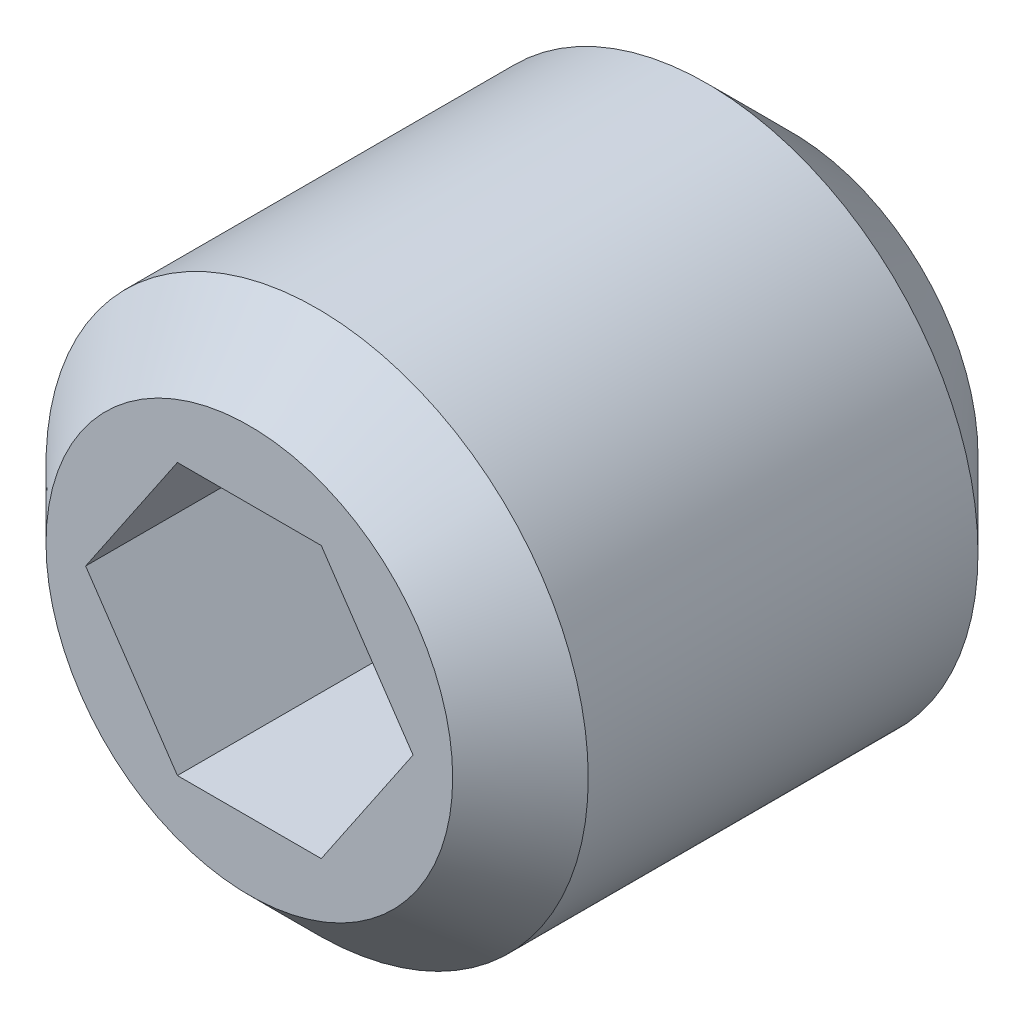
ISO-10303-21;
HEADER;
FILE_DESCRIPTION(('STEP AP214'),'2;1');
FILE_NAME('part.step','',(''),(''),'','','');
FILE_SCHEMA(('AUTOMOTIVE_DESIGN { 1 0 10303 214 1 1 1 1 }'));
ENDSEC;
DATA;
#1=APPLICATION_CONTEXT('core data for automotive mechanical design processes');
#2=APPLICATION_PROTOCOL_DEFINITION('international standard','automotive_design',2000,#1);
#3=PRODUCT_CONTEXT('',#1,'mechanical');
#4=PRODUCT('Part','Part','',(#3));
#5=PRODUCT_RELATED_PRODUCT_CATEGORY('part','',(#4));
#6=PRODUCT_DEFINITION_FORMATION('','',#4);
#7=PRODUCT_DEFINITION_CONTEXT('part definition',#1,'design');
#8=PRODUCT_DEFINITION('design','',#6,#7);
#9=PRODUCT_DEFINITION_SHAPE('','',#8);
#10=(LENGTH_UNIT() NAMED_UNIT(*) SI_UNIT(.MILLI.,.METRE.));
#11=(NAMED_UNIT(*) PLANE_ANGLE_UNIT() SI_UNIT($,.RADIAN.));
#12=(NAMED_UNIT(*) SI_UNIT($,.STERADIAN.) SOLID_ANGLE_UNIT());
#13=UNCERTAINTY_MEASURE_WITH_UNIT(LENGTH_MEASURE(1.E-05),#10,'distance_accuracy_value','');
#14=(GEOMETRIC_REPRESENTATION_CONTEXT(3) GLOBAL_UNCERTAINTY_ASSIGNED_CONTEXT((#13)) GLOBAL_UNIT_ASSIGNED_CONTEXT((#10,
#11,#12)) REPRESENTATION_CONTEXT('',''));
#15=CARTESIAN_POINT('',(0.,0.,0.));
#16=DIRECTION('',(0.,0.,1.));
#17=DIRECTION('',(1.,0.,0.));
#18=AXIS2_PLACEMENT_3D('',#15,#16,#17);
#19=CARTESIAN_POINT('',(0.,0.,8.00000000000007));
#20=DIRECTION('',(0.,0.,-1.));
#21=DIRECTION('',(-1.,0.,0.));
#22=AXIS2_PLACEMENT_3D('',#19,#20,#21);
#23=CYLINDRICAL_SURFACE('',#22,4.);
#24=CARTESIAN_POINT('',(0.,0.,7.00000000000012));
#25=DIRECTION('',(0.,0.,1.));
#26=DIRECTION('',(1.,0.,0.));
#27=AXIS2_PLACEMENT_3D('',#24,#25,#26);
#28=CIRCLE('',#27,4.);
#29=CARTESIAN_POINT('',(4.,0.,7.00000000000011));
#30=VERTEX_POINT('',#29);
#31=EDGE_CURVE('E11',#30,#30,#28,.F.);
#32=ORIENTED_EDGE('',*,*,#31,.T.);
#33=EDGE_LOOP('',(#32));
#34=FACE_BOUND('',#33,.T.);
#35=CARTESIAN_POINT('',(0.,0.,1.25000000000011));
#36=DIRECTION('',(0.,0.,1.));
#37=DIRECTION('',(1.,0.,0.));
#38=AXIS2_PLACEMENT_3D('',#35,#36,#37);
#39=CIRCLE('',#38,4.);
#40=CARTESIAN_POINT('',(4.,0.,1.25000000000011));
#41=VERTEX_POINT('',#40);
#42=EDGE_CURVE('E141',#41,#41,#39,.T.);
#43=ORIENTED_EDGE('',*,*,#42,.T.);
#44=EDGE_LOOP('',(#43));
#45=FACE_BOUND('',#44,.T.);
#46=ADVANCED_FACE('F34',(#34,#45),#23,.T.);
#47=CARTESIAN_POINT('',(0.,0.,8.00000000000007));
#48=DIRECTION('',(0.,0.,1.));
#49=DIRECTION('',(1.,0.,0.));
#50=AXIS2_PLACEMENT_3D('',#47,#48,#49);
#51=PLANE('',#50);
#52=CARTESIAN_POINT('',(0.,0.,8.00000000000007));
#53=DIRECTION('',(0.,0.,1.));
#54=DIRECTION('',(1.,0.,0.));
#55=AXIS2_PLACEMENT_3D('',#52,#53,#54);
#56=CIRCLE('',#55,2.99999999999998);
#57=CARTESIAN_POINT('',(2.99999999999997,0.,8.00000000000007));
#58=VERTEX_POINT('',#57);
#59=EDGE_CURVE('E41',#58,#58,#56,.T.);
#60=ORIENTED_EDGE('',*,*,#59,.T.);
#61=EDGE_LOOP('',(#60));
#62=FACE_BOUND('',#61,.T.);
#63=DIRECTION('',(0.560582505827001,0.828098577562311,0.));
#64=VECTOR('',#63,1.);
#65=CARTESIAN_POINT('',(1.06126856410381,-2.00000000000011,8.00000000000015));
#66=LINE('',#65,#64);
#67=CARTESIAN_POINT('',(1.06126856410381,-2.00000000000011,8.00000000000015));
#68=VERTEX_POINT('',#67);
#69=CARTESIAN_POINT('',(2.41517139890206,0.,8.00000000000013));
#70=VERTEX_POINT('',#69);
#71=EDGE_CURVE('E48',#68,#70,#66,.T.);
#72=ORIENTED_EDGE('',*,*,#71,.F.);
#73=DIRECTION('',(1.,0.,0.));
#74=VECTOR('',#73,1.);
#75=CARTESIAN_POINT('',(-1.06126856410403,-2.00000000000013,8.00000000000012));
#76=LINE('',#75,#74);
#77=CARTESIAN_POINT('',(-1.06126856410403,-2.00000000000013,8.00000000000012));
#78=VERTEX_POINT('',#77);
#79=EDGE_CURVE('E117',#78,#68,#76,.T.);
#80=ORIENTED_EDGE('',*,*,#79,.F.);
#81=DIRECTION('',(0.560582505826999,-0.82809857756231,0.));
#82=VECTOR('',#81,1.);
#83=CARTESIAN_POINT('',(-2.41517139890215,0.,8.00000000000001));
#84=LINE('',#83,#82);
#85=CARTESIAN_POINT('',(-2.41517139890215,0.,8.00000000000001));
#86=VERTEX_POINT('',#85);
#87=EDGE_CURVE('E111',#86,#78,#84,.T.);
#88=ORIENTED_EDGE('',*,*,#87,.F.);
#89=DIRECTION('',(-0.560582505827001,-0.828098577562311,0.));
#90=VECTOR('',#89,1.);
#91=CARTESIAN_POINT('',(-1.06126856410401,1.99999999999989,8.0000000000001));
#92=LINE('',#91,#90);
#93=CARTESIAN_POINT('',(-1.06126856410401,1.99999999999989,8.0000000000001));
#94=VERTEX_POINT('',#93);
#95=EDGE_CURVE('E109',#94,#86,#92,.T.);
#96=ORIENTED_EDGE('',*,*,#95,.F.);
#97=DIRECTION('',(-1.,0.,0.));
#98=VECTOR('',#97,1.);
#99=CARTESIAN_POINT('',(1.06126856410382,1.99999999999993,8.00000000000016));
#100=LINE('',#99,#98);
#101=CARTESIAN_POINT('',(1.06126856410382,1.99999999999993,8.00000000000016));
#102=VERTEX_POINT('',#101);
#103=EDGE_CURVE('E91',#102,#94,#100,.T.);
#104=ORIENTED_EDGE('',*,*,#103,.F.);
#105=DIRECTION('',(-0.560582505826999,0.82809857756231,0.));
#106=VECTOR('',#105,1.);
#107=CARTESIAN_POINT('',(2.41517139890206,0.,8.00000000000013));
#108=LINE('',#107,#106);
#109=EDGE_CURVE('E102',#70,#102,#108,.T.);
#110=ORIENTED_EDGE('',*,*,#109,.F.);
#111=EDGE_LOOP('',(#72,#80,#88,#96,#104,#110));
#112=FACE_BOUND('',#111,.T.);
#113=ADVANCED_FACE('F106',(#62,#112),#51,.T.);
#114=CARTESIAN_POINT('',(-1.21430643318376E-13,0.,1.2490009027033E-13));
#115=DIRECTION('',(0.,0.,1.));
#116=DIRECTION('',(1.,0.,0.));
#117=AXIS2_PLACEMENT_3D('',#114,#115,#116);
#118=PLANE('',#117);
#119=CARTESIAN_POINT('',(-1.21430643318376E-13,0.,1.2490009027033E-13));
#120=DIRECTION('',(0.,0.,1.));
#121=DIRECTION('',(1.,0.,0.));
#122=AXIS2_PLACEMENT_3D('',#119,#120,#121);
#123=CIRCLE('',#122,2.74999999999999);
#124=CARTESIAN_POINT('',(2.74999999999987,0.,1.21617993453782E-13));
#125=VERTEX_POINT('',#124);
#126=EDGE_CURVE('E144',#125,#125,#123,.F.);
#127=ORIENTED_EDGE('',*,*,#126,.T.);
#128=EDGE_LOOP('',(#127));
#129=FACE_BOUND('',#128,.T.);
#130=ADVANCED_FACE('F164',(#129),#118,.F.);
#131=CARTESIAN_POINT('',(0.,0.,1.25000000000011));
#132=DIRECTION('',(0.,0.,1.));
#133=DIRECTION('',(1.,0.,0.));
#134=AXIS2_PLACEMENT_3D('',#131,#132,#133);
#135=CONICAL_SURFACE('',#134,4.,0.785398163397443);
#136=ORIENTED_EDGE('',*,*,#126,.F.);
#137=EDGE_LOOP('',(#136));
#138=FACE_BOUND('',#137,.T.);
#139=ORIENTED_EDGE('',*,*,#42,.F.);
#140=EDGE_LOOP('',(#139));
#141=FACE_BOUND('',#140,.T.);
#142=ADVANCED_FACE('F169',(#138,#141),#135,.T.);
#143=CARTESIAN_POINT('',(1.06126856410385,-2.00000000000004,4.00000000000005));
#144=DIRECTION('',(0.828098577562312,-0.560582505827,0.));
#145=DIRECTION('',(0.560582505827001,0.828098577562311,0.));
#146=AXIS2_PLACEMENT_3D('',#143,#144,#145);
#147=PLANE('',#146);
#148=DIRECTION('',(0.,0.,1.));
#149=VECTOR('',#148,1.);
#150=CARTESIAN_POINT('',(1.06126856410385,-2.00000000000004,4.00000000000005));
#151=LINE('',#150,#149);
#152=CARTESIAN_POINT('',(1.06126856410385,-2.00000000000004,4.00000000000005));
#153=VERTEX_POINT('',#152);
#154=EDGE_CURVE('E55',#153,#68,#151,.T.);
#155=ORIENTED_EDGE('',*,*,#154,.T.);
#156=ORIENTED_EDGE('',*,*,#71,.T.);
#157=DIRECTION('',(0.,0.,1.));
#158=VECTOR('',#157,1.);
#159=CARTESIAN_POINT('',(2.41517139890206,0.,4.00000000000016));
#160=LINE('',#159,#158);
#161=CARTESIAN_POINT('',(2.41517139890206,0.,4.00000000000016));
#162=VERTEX_POINT('',#161);
#163=EDGE_CURVE('E99',#162,#70,#160,.T.);
#164=ORIENTED_EDGE('',*,*,#163,.F.);
#165=DIRECTION('',(0.560582505827001,0.828098577562311,0.));
#166=VECTOR('',#165,1.);
#167=CARTESIAN_POINT('',(1.06126856410385,-2.00000000000004,4.00000000000005));
#168=LINE('',#167,#166);
#169=EDGE_CURVE('E119',#153,#162,#168,.T.);
#170=ORIENTED_EDGE('',*,*,#169,.F.);
#171=EDGE_LOOP('',(#155,#156,#164,#170));
#172=FACE_BOUND('',#171,.T.);
#173=ADVANCED_FACE('F176',(#172),#147,.F.);
#174=CARTESIAN_POINT('',(-1.06126856410389,-2.00000000000004,4.00000000000011));
#175=DIRECTION('',(0.,-1.,0.));
#176=DIRECTION('',(0.,0.,-1.));
#177=AXIS2_PLACEMENT_3D('',#174,#175,#176);
#178=PLANE('',#177);
#179=DIRECTION('',(0.,0.,1.));
#180=VECTOR('',#179,1.);
#181=CARTESIAN_POINT('',(-1.06126856410389,-2.00000000000004,4.00000000000011));
#182=LINE('',#181,#180);
#183=CARTESIAN_POINT('',(-1.06126856410389,-2.00000000000004,4.00000000000011));
#184=VERTEX_POINT('',#183);
#185=EDGE_CURVE('E138',#184,#78,#182,.T.);
#186=ORIENTED_EDGE('',*,*,#185,.T.);
#187=ORIENTED_EDGE('',*,*,#79,.T.);
#188=ORIENTED_EDGE('',*,*,#154,.F.);
#189=DIRECTION('',(1.,0.,0.));
#190=VECTOR('',#189,1.);
#191=CARTESIAN_POINT('',(-1.06126856410389,-2.00000000000004,4.00000000000011));
#192=LINE('',#191,#190);
#193=EDGE_CURVE('E131',#184,#153,#192,.T.);
#194=ORIENTED_EDGE('',*,*,#193,.F.);
#195=EDGE_LOOP('',(#186,#187,#188,#194));
#196=FACE_BOUND('',#195,.T.);
#197=ADVANCED_FACE('F178',(#196),#178,.F.);
#198=CARTESIAN_POINT('',(-2.41517139890217,0.,4.00000000000014));
#199=DIRECTION('',(-0.828098577562312,-0.560582505827,0.));
#200=DIRECTION('',(0.560582505826999,-0.828098577562311,0.));
#201=AXIS2_PLACEMENT_3D('',#198,#199,#200);
#202=PLANE('',#201);
#203=DIRECTION('',(0.,0.,1.));
#204=VECTOR('',#203,1.);
#205=CARTESIAN_POINT('',(-2.41517139890217,0.,4.00000000000014));
#206=LINE('',#205,#204);
#207=CARTESIAN_POINT('',(-2.41517139890217,0.,4.00000000000014));
#208=VERTEX_POINT('',#207);
#209=EDGE_CURVE('E136',#208,#86,#206,.T.);
#210=ORIENTED_EDGE('',*,*,#209,.T.);
#211=ORIENTED_EDGE('',*,*,#87,.T.);
#212=ORIENTED_EDGE('',*,*,#185,.F.);
#213=DIRECTION('',(0.560582505826999,-0.82809857756231,0.));
#214=VECTOR('',#213,1.);
#215=CARTESIAN_POINT('',(-2.41517139890217,0.,4.00000000000014));
#216=LINE('',#215,#214);
#217=EDGE_CURVE('E128',#208,#184,#216,.T.);
#218=ORIENTED_EDGE('',*,*,#217,.F.);
#219=EDGE_LOOP('',(#210,#211,#212,#218));
#220=FACE_BOUND('',#219,.T.);
#221=ADVANCED_FACE('F181',(#220),#202,.F.);
#222=CARTESIAN_POINT('',(-1.0612685641039,1.99999999999999,4.00000000000015));
#223=DIRECTION('',(-0.828098577562312,0.560582505827,0.));
#224=DIRECTION('',(-0.560582505827001,-0.828098577562311,0.));
#225=AXIS2_PLACEMENT_3D('',#222,#223,#224);
#226=PLANE('',#225);
#227=DIRECTION('',(0.,0.,1.));
#228=VECTOR('',#227,1.);
#229=CARTESIAN_POINT('',(-1.0612685641039,1.99999999999999,4.00000000000015));
#230=LINE('',#229,#228);
#231=CARTESIAN_POINT('',(-1.0612685641039,1.99999999999999,4.00000000000015));
#232=VERTEX_POINT('',#231);
#233=EDGE_CURVE('E98',#232,#94,#230,.T.);
#234=ORIENTED_EDGE('',*,*,#233,.T.);
#235=ORIENTED_EDGE('',*,*,#95,.T.);
#236=ORIENTED_EDGE('',*,*,#209,.F.);
#237=DIRECTION('',(-0.560582505827001,-0.828098577562311,0.));
#238=VECTOR('',#237,1.);
#239=CARTESIAN_POINT('',(-1.0612685641039,1.99999999999999,4.00000000000015));
#240=LINE('',#239,#238);
#241=EDGE_CURVE('E125',#232,#208,#240,.T.);
#242=ORIENTED_EDGE('',*,*,#241,.F.);
#243=EDGE_LOOP('',(#234,#235,#236,#242));
#244=FACE_BOUND('',#243,.T.);
#245=ADVANCED_FACE('F184',(#244),#226,.F.);
#246=CARTESIAN_POINT('',(1.06126856410388,2.,4.));
#247=DIRECTION('',(0.,1.,0.));
#248=DIRECTION('',(0.,0.,1.));
#249=AXIS2_PLACEMENT_3D('',#246,#247,#248);
#250=PLANE('',#249);
#251=DIRECTION('',(0.,0.,1.));
#252=VECTOR('',#251,1.);
#253=CARTESIAN_POINT('',(1.06126856410388,2.,4.));
#254=LINE('',#253,#252);
#255=CARTESIAN_POINT('',(1.06126856410388,2.,4.));
#256=VERTEX_POINT('',#255);
#257=EDGE_CURVE('E87',#256,#102,#254,.T.);
#258=ORIENTED_EDGE('',*,*,#257,.T.);
#259=ORIENTED_EDGE('',*,*,#103,.T.);
#260=ORIENTED_EDGE('',*,*,#233,.F.);
#261=DIRECTION('',(-1.,0.,0.));
#262=VECTOR('',#261,1.);
#263=CARTESIAN_POINT('',(1.06126856410388,2.,4.));
#264=LINE('',#263,#262);
#265=EDGE_CURVE('E94',#256,#232,#264,.T.);
#266=ORIENTED_EDGE('',*,*,#265,.F.);
#267=EDGE_LOOP('',(#258,#259,#260,#266));
#268=FACE_BOUND('',#267,.T.);
#269=ADVANCED_FACE('F89',(#268),#250,.F.);
#270=CARTESIAN_POINT('',(2.41517139890206,0.,4.00000000000016));
#271=DIRECTION('',(0.828098577562312,0.560582505827,0.));
#272=DIRECTION('',(-0.560582505826999,0.828098577562311,0.));
#273=AXIS2_PLACEMENT_3D('',#270,#271,#272);
#274=PLANE('',#273);
#275=DIRECTION('',(-0.560582505826999,0.82809857756231,0.));
#276=VECTOR('',#275,1.);
#277=CARTESIAN_POINT('',(2.41517139890206,0.,4.00000000000016));
#278=LINE('',#277,#276);
#279=EDGE_CURVE('E122',#162,#256,#278,.T.);
#280=ORIENTED_EDGE('',*,*,#279,.F.);
#281=ORIENTED_EDGE('',*,*,#163,.T.);
#282=ORIENTED_EDGE('',*,*,#109,.T.);
#283=ORIENTED_EDGE('',*,*,#257,.F.);
#284=EDGE_LOOP('',(#280,#281,#282,#283));
#285=FACE_BOUND('',#284,.T.);
#286=ADVANCED_FACE('F103',(#285),#274,.F.);
#287=CARTESIAN_POINT('',(2.41517139890206,0.,4.00000000000016));
#288=DIRECTION('',(0.,0.,1.));
#289=DIRECTION('',(1.,0.,0.));
#290=AXIS2_PLACEMENT_3D('',#287,#288,#289);
#291=PLANE('',#290);
#292=ORIENTED_EDGE('',*,*,#169,.T.);
#293=ORIENTED_EDGE('',*,*,#279,.T.);
#294=ORIENTED_EDGE('',*,*,#265,.T.);
#295=ORIENTED_EDGE('',*,*,#241,.T.);
#296=ORIENTED_EDGE('',*,*,#217,.T.);
#297=ORIENTED_EDGE('',*,*,#193,.T.);
#298=EDGE_LOOP('',(#292,#293,#294,#295,#296,#297));
#299=FACE_BOUND('',#298,.T.);
#300=ADVANCED_FACE('F152',(#299),#291,.T.);
#301=CARTESIAN_POINT('',(0.,0.,8.00000000000007));
#302=DIRECTION('',(0.,0.,-1.));
#303=DIRECTION('',(-1.,0.,0.));
#304=AXIS2_PLACEMENT_3D('',#301,#302,#303);
#305=CONICAL_SURFACE('',#304,2.99999999999998,0.785398163397453);
#306=ORIENTED_EDGE('',*,*,#31,.F.);
#307=EDGE_LOOP('',(#306));
#308=FACE_BOUND('',#307,.T.);
#309=ORIENTED_EDGE('',*,*,#59,.F.);
#310=EDGE_LOOP('',(#309));
#311=FACE_BOUND('',#310,.T.);
#312=ADVANCED_FACE('F150',(#308,#311),#305,.T.);
#313=CLOSED_SHELL('',(#46,#113,#130,#142,#173,#197,#221,#245,#269,#286,#300,#312));
#314=MANIFOLD_SOLID_BREP('B2',#313);
#315=ADVANCED_BREP_SHAPE_REPRESENTATION('',(#18,#314),#14);
#316=SHAPE_DEFINITION_REPRESENTATION(#9,#315);
ENDSEC;
END-ISO-10303-21;
